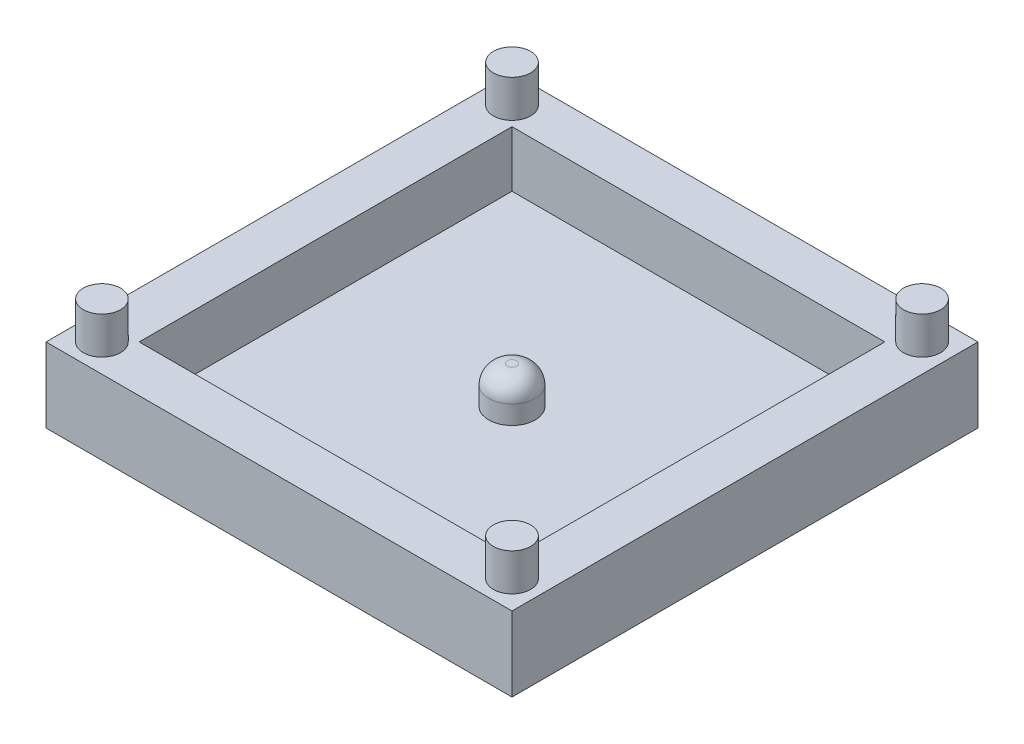
ISO-10303-21;
HEADER;
FILE_DESCRIPTION(('STEP AP214'),'2;1');
FILE_NAME('part.step','',(''),(''),'','','');
FILE_SCHEMA(('AUTOMOTIVE_DESIGN { 1 0 10303 214 1 1 1 1 }'));
ENDSEC;
DATA;
#1=APPLICATION_CONTEXT('core data for automotive mechanical design processes');
#2=APPLICATION_PROTOCOL_DEFINITION('international standard','automotive_design',2000,#1);
#3=PRODUCT_CONTEXT('',#1,'mechanical');
#4=PRODUCT('Part','Part','',(#3));
#5=PRODUCT_RELATED_PRODUCT_CATEGORY('part','',(#4));
#6=PRODUCT_DEFINITION_FORMATION('','',#4);
#7=PRODUCT_DEFINITION_CONTEXT('part definition',#1,'design');
#8=PRODUCT_DEFINITION('design','',#6,#7);
#9=PRODUCT_DEFINITION_SHAPE('','',#8);
#10=(LENGTH_UNIT() NAMED_UNIT(*) SI_UNIT(.MILLI.,.METRE.));
#11=(NAMED_UNIT(*) PLANE_ANGLE_UNIT() SI_UNIT($,.RADIAN.));
#12=(NAMED_UNIT(*) SI_UNIT($,.STERADIAN.) SOLID_ANGLE_UNIT());
#13=UNCERTAINTY_MEASURE_WITH_UNIT(LENGTH_MEASURE(1.E-05),#10,'distance_accuracy_value','');
#14=(GEOMETRIC_REPRESENTATION_CONTEXT(3) GLOBAL_UNCERTAINTY_ASSIGNED_CONTEXT((#13)) GLOBAL_UNIT_ASSIGNED_CONTEXT((#10,
#11,#12)) REPRESENTATION_CONTEXT('',''));
#15=CARTESIAN_POINT('',(0.,0.,0.));
#16=DIRECTION('',(0.,0.,1.));
#17=DIRECTION('',(1.,0.,0.));
#18=AXIS2_PLACEMENT_3D('',#15,#16,#17);
#19=CARTESIAN_POINT('',(12.5,4.,12.5));
#20=DIRECTION('',(-1.,0.,0.));
#21=DIRECTION('',(0.,0.,1.));
#22=AXIS2_PLACEMENT_3D('',#19,#20,#21);
#23=PLANE('',#22);
#24=DIRECTION('',(0.,0.,-1.));
#25=VECTOR('',#24,1.);
#26=CARTESIAN_POINT('',(12.5,0.,12.5));
#27=LINE('',#26,#25);
#28=CARTESIAN_POINT('',(12.5,0.,12.5));
#29=VERTEX_POINT('',#28);
#30=CARTESIAN_POINT('',(12.5,0.,-12.5));
#31=VERTEX_POINT('',#30);
#32=EDGE_CURVE('E146',#29,#31,#27,.T.);
#33=ORIENTED_EDGE('',*,*,#32,.T.);
#34=DIRECTION('',(0.,-1.,0.));
#35=VECTOR('',#34,1.);
#36=CARTESIAN_POINT('',(12.5,4.,-12.5));
#37=LINE('',#36,#35);
#38=CARTESIAN_POINT('',(12.5,4.,-12.5));
#39=VERTEX_POINT('',#38);
#40=EDGE_CURVE('E170',#39,#31,#37,.T.);
#41=ORIENTED_EDGE('',*,*,#40,.F.);
#42=DIRECTION('',(0.,0.,-1.));
#43=VECTOR('',#42,1.);
#44=CARTESIAN_POINT('',(12.5,4.,12.5));
#45=LINE('',#44,#43);
#46=CARTESIAN_POINT('',(12.5,4.,12.5));
#47=VERTEX_POINT('',#46);
#48=EDGE_CURVE('E150',#47,#39,#45,.T.);
#49=ORIENTED_EDGE('',*,*,#48,.F.);
#50=DIRECTION('',(0.,-1.,0.));
#51=VECTOR('',#50,1.);
#52=CARTESIAN_POINT('',(12.5,4.,12.5));
#53=LINE('',#52,#51);
#54=EDGE_CURVE('E156',#47,#29,#53,.T.);
#55=ORIENTED_EDGE('',*,*,#54,.T.);
#56=EDGE_LOOP('',(#33,#41,#49,#55));
#57=FACE_BOUND('',#56,.T.);
#58=ADVANCED_FACE('F33',(#57),#23,.F.);
#59=CARTESIAN_POINT('',(-12.5,4.,-12.5));
#60=DIRECTION('',(0.,0.,1.));
#61=DIRECTION('',(1.,0.,0.));
#62=AXIS2_PLACEMENT_3D('',#59,#60,#61);
#63=PLANE('',#62);
#64=DIRECTION('',(-1.,0.,0.));
#65=VECTOR('',#64,1.);
#66=CARTESIAN_POINT('',(-12.5,0.,-12.5));
#67=LINE('',#66,#65);
#68=CARTESIAN_POINT('',(-12.5,0.,-12.5));
#69=VERTEX_POINT('',#68);
#70=EDGE_CURVE('E159',#31,#69,#67,.T.);
#71=ORIENTED_EDGE('',*,*,#70,.T.);
#72=DIRECTION('',(0.,-1.,0.));
#73=VECTOR('',#72,1.);
#74=CARTESIAN_POINT('',(-12.5,4.,-12.5));
#75=LINE('',#74,#73);
#76=CARTESIAN_POINT('',(-12.5,4.,-12.5));
#77=VERTEX_POINT('',#76);
#78=EDGE_CURVE('E167',#77,#69,#75,.T.);
#79=ORIENTED_EDGE('',*,*,#78,.F.);
#80=DIRECTION('',(-1.,0.,0.));
#81=VECTOR('',#80,1.);
#82=CARTESIAN_POINT('',(-12.5,4.,-12.5));
#83=LINE('',#82,#81);
#84=EDGE_CURVE('E86',#39,#77,#83,.T.);
#85=ORIENTED_EDGE('',*,*,#84,.F.);
#86=ORIENTED_EDGE('',*,*,#40,.T.);
#87=EDGE_LOOP('',(#71,#79,#85,#86));
#88=FACE_BOUND('',#87,.T.);
#89=ADVANCED_FACE('F207',(#88),#63,.F.);
#90=CARTESIAN_POINT('',(-12.5,4.,12.5));
#91=DIRECTION('',(1.,0.,0.));
#92=DIRECTION('',(0.,0.,-1.));
#93=AXIS2_PLACEMENT_3D('',#90,#91,#92);
#94=PLANE('',#93);
#95=DIRECTION('',(0.,0.,1.));
#96=VECTOR('',#95,1.);
#97=CARTESIAN_POINT('',(-12.5,0.,12.5));
#98=LINE('',#97,#96);
#99=CARTESIAN_POINT('',(-12.5,0.,12.5));
#100=VERTEX_POINT('',#99);
#101=EDGE_CURVE('E161',#69,#100,#98,.T.);
#102=ORIENTED_EDGE('',*,*,#101,.T.);
#103=DIRECTION('',(0.,-1.,0.));
#104=VECTOR('',#103,1.);
#105=CARTESIAN_POINT('',(-12.5,4.,12.5));
#106=LINE('',#105,#104);
#107=CARTESIAN_POINT('',(-12.5,4.,12.5));
#108=VERTEX_POINT('',#107);
#109=EDGE_CURVE('E165',#108,#100,#106,.T.);
#110=ORIENTED_EDGE('',*,*,#109,.F.);
#111=DIRECTION('',(0.,0.,1.));
#112=VECTOR('',#111,1.);
#113=CARTESIAN_POINT('',(-12.5,4.,12.5));
#114=LINE('',#113,#112);
#115=EDGE_CURVE('E153',#77,#108,#114,.T.);
#116=ORIENTED_EDGE('',*,*,#115,.F.);
#117=ORIENTED_EDGE('',*,*,#78,.T.);
#118=EDGE_LOOP('',(#102,#110,#116,#117));
#119=FACE_BOUND('',#118,.T.);
#120=ADVANCED_FACE('F212',(#119),#94,.F.);
#121=CARTESIAN_POINT('',(-12.5,4.,12.5));
#122=DIRECTION('',(0.,0.,-1.));
#123=DIRECTION('',(-1.,0.,0.));
#124=AXIS2_PLACEMENT_3D('',#121,#122,#123);
#125=PLANE('',#124);
#126=DIRECTION('',(1.,0.,0.));
#127=VECTOR('',#126,1.);
#128=CARTESIAN_POINT('',(-12.5,0.,12.5));
#129=LINE('',#128,#127);
#130=EDGE_CURVE('E78',#100,#29,#129,.T.);
#131=ORIENTED_EDGE('',*,*,#130,.T.);
#132=ORIENTED_EDGE('',*,*,#54,.F.);
#133=DIRECTION('',(1.,0.,0.));
#134=VECTOR('',#133,1.);
#135=CARTESIAN_POINT('',(-12.5,4.,12.5));
#136=LINE('',#135,#134);
#137=EDGE_CURVE('E57',#108,#47,#136,.T.);
#138=ORIENTED_EDGE('',*,*,#137,.F.);
#139=ORIENTED_EDGE('',*,*,#109,.T.);
#140=EDGE_LOOP('',(#131,#132,#138,#139));
#141=FACE_BOUND('',#140,.T.);
#142=ADVANCED_FACE('F195',(#141),#125,.F.);
#143=CARTESIAN_POINT('',(0.,4.,0.));
#144=DIRECTION('',(0.,-1.,0.));
#145=DIRECTION('',(0.,0.,-1.));
#146=AXIS2_PLACEMENT_3D('',#143,#144,#145);
#147=PLANE('',#146);
#148=CARTESIAN_POINT('',(-11.,4.,11.));
#149=DIRECTION('',(0.,-1.,0.));
#150=DIRECTION('',(0.,0.,-1.));
#151=AXIS2_PLACEMENT_3D('',#148,#149,#150);
#152=CIRCLE('',#151,1.);
#153=CARTESIAN_POINT('',(-11.,4.,10.));
#154=VERTEX_POINT('',#153);
#155=EDGE_CURVE('E11',#154,#154,#152,.F.);
#156=ORIENTED_EDGE('',*,*,#155,.F.);
#157=EDGE_LOOP('',(#156));
#158=FACE_BOUND('',#157,.T.);
#159=CARTESIAN_POINT('',(11.,4.,11.));
#160=DIRECTION('',(0.,-1.,0.));
#161=DIRECTION('',(0.,0.,-1.));
#162=AXIS2_PLACEMENT_3D('',#159,#160,#161);
#163=CIRCLE('',#162,1.);
#164=CARTESIAN_POINT('',(11.,4.,10.));
#165=VERTEX_POINT('',#164);
#166=EDGE_CURVE('E41',#165,#165,#163,.F.);
#167=ORIENTED_EDGE('',*,*,#166,.F.);
#168=EDGE_LOOP('',(#167));
#169=FACE_BOUND('',#168,.T.);
#170=CARTESIAN_POINT('',(11.,4.,-11.));
#171=DIRECTION('',(0.,-1.,0.));
#172=DIRECTION('',(0.,0.,-1.));
#173=AXIS2_PLACEMENT_3D('',#170,#171,#172);
#174=CIRCLE('',#173,1.);
#175=CARTESIAN_POINT('',(11.,4.,-12.));
#176=VERTEX_POINT('',#175);
#177=EDGE_CURVE('E184',#176,#176,#174,.F.);
#178=ORIENTED_EDGE('',*,*,#177,.F.);
#179=EDGE_LOOP('',(#178));
#180=FACE_BOUND('',#179,.T.);
#181=CARTESIAN_POINT('',(-11.,4.,-11.));
#182=DIRECTION('',(0.,-1.,0.));
#183=DIRECTION('',(0.,0.,-1.));
#184=AXIS2_PLACEMENT_3D('',#181,#182,#183);
#185=CIRCLE('',#184,1.);
#186=CARTESIAN_POINT('',(-11.,4.,-12.));
#187=VERTEX_POINT('',#186);
#188=EDGE_CURVE('E181',#187,#187,#185,.F.);
#189=ORIENTED_EDGE('',*,*,#188,.F.);
#190=EDGE_LOOP('',(#189));
#191=FACE_BOUND('',#190,.T.);
#192=DIRECTION('',(-1.,0.,0.));
#193=VECTOR('',#192,1.);
#194=CARTESIAN_POINT('',(-10.,4.,-10.));
#195=LINE('',#194,#193);
#196=CARTESIAN_POINT('',(10.,4.,-10.));
#197=VERTEX_POINT('',#196);
#198=CARTESIAN_POINT('',(-10.,4.,-10.));
#199=VERTEX_POINT('',#198);
#200=EDGE_CURVE('E140',#197,#199,#195,.T.);
#201=ORIENTED_EDGE('',*,*,#200,.F.);
#202=DIRECTION('',(0.,0.,-1.));
#203=VECTOR('',#202,1.);
#204=CARTESIAN_POINT('',(10.,4.,10.));
#205=LINE('',#204,#203);
#206=CARTESIAN_POINT('',(10.,4.,10.));
#207=VERTEX_POINT('',#206);
#208=EDGE_CURVE('E48',#207,#197,#205,.T.);
#209=ORIENTED_EDGE('',*,*,#208,.F.);
#210=DIRECTION('',(1.,0.,0.));
#211=VECTOR('',#210,1.);
#212=CARTESIAN_POINT('',(-10.,4.,10.));
#213=LINE('',#212,#211);
#214=CARTESIAN_POINT('',(-10.,4.,10.));
#215=VERTEX_POINT('',#214);
#216=EDGE_CURVE('E128',#215,#207,#213,.T.);
#217=ORIENTED_EDGE('',*,*,#216,.F.);
#218=DIRECTION('',(0.,0.,1.));
#219=VECTOR('',#218,1.);
#220=CARTESIAN_POINT('',(-10.,4.,10.));
#221=LINE('',#220,#219);
#222=EDGE_CURVE('E131',#199,#215,#221,.T.);
#223=ORIENTED_EDGE('',*,*,#222,.F.);
#224=EDGE_LOOP('',(#201,#209,#217,#223));
#225=FACE_BOUND('',#224,.T.);
#226=ORIENTED_EDGE('',*,*,#48,.T.);
#227=ORIENTED_EDGE('',*,*,#84,.T.);
#228=ORIENTED_EDGE('',*,*,#115,.T.);
#229=ORIENTED_EDGE('',*,*,#137,.T.);
#230=EDGE_LOOP('',(#226,#227,#228,#229));
#231=FACE_BOUND('',#230,.T.);
#232=ADVANCED_FACE('F191',(#158,#169,#180,#191,#225,#231),#147,.F.);
#233=CARTESIAN_POINT('',(0.,0.,0.));
#234=DIRECTION('',(0.,-1.,0.));
#235=DIRECTION('',(0.,0.,-1.));
#236=AXIS2_PLACEMENT_3D('',#233,#234,#235);
#237=PLANE('',#236);
#238=ORIENTED_EDGE('',*,*,#32,.F.);
#239=ORIENTED_EDGE('',*,*,#130,.F.);
#240=ORIENTED_EDGE('',*,*,#101,.F.);
#241=ORIENTED_EDGE('',*,*,#70,.F.);
#242=EDGE_LOOP('',(#238,#239,#240,#241));
#243=FACE_BOUND('',#242,.T.);
#244=ADVANCED_FACE('F194',(#243),#237,.T.);
#245=CARTESIAN_POINT('',(10.,1.,10.));
#246=DIRECTION('',(1.,0.,0.));
#247=DIRECTION('',(0.,0.,-1.));
#248=AXIS2_PLACEMENT_3D('',#245,#246,#247);
#249=PLANE('',#248);
#250=ORIENTED_EDGE('',*,*,#208,.T.);
#251=DIRECTION('',(0.,1.,0.));
#252=VECTOR('',#251,1.);
#253=CARTESIAN_POINT('',(10.,1.,-10.));
#254=LINE('',#253,#252);
#255=CARTESIAN_POINT('',(10.,1.,-10.));
#256=VERTEX_POINT('',#255);
#257=EDGE_CURVE('E106',#256,#197,#254,.T.);
#258=ORIENTED_EDGE('',*,*,#257,.F.);
#259=DIRECTION('',(0.,0.,-1.));
#260=VECTOR('',#259,1.);
#261=CARTESIAN_POINT('',(10.,1.,10.));
#262=LINE('',#261,#260);
#263=CARTESIAN_POINT('',(10.,1.,10.));
#264=VERTEX_POINT('',#263);
#265=EDGE_CURVE('E110',#264,#256,#262,.T.);
#266=ORIENTED_EDGE('',*,*,#265,.F.);
#267=DIRECTION('',(0.,1.,0.));
#268=VECTOR('',#267,1.);
#269=CARTESIAN_POINT('',(10.,1.,10.));
#270=LINE('',#269,#268);
#271=EDGE_CURVE('E144',#264,#207,#270,.T.);
#272=ORIENTED_EDGE('',*,*,#271,.T.);
#273=EDGE_LOOP('',(#250,#258,#266,#272));
#274=FACE_BOUND('',#273,.T.);
#275=ADVANCED_FACE('F108',(#274),#249,.F.);
#276=CARTESIAN_POINT('',(-10.,1.,10.));
#277=DIRECTION('',(0.,0.,1.));
#278=DIRECTION('',(1.,0.,0.));
#279=AXIS2_PLACEMENT_3D('',#276,#277,#278);
#280=PLANE('',#279);
#281=ORIENTED_EDGE('',*,*,#216,.T.);
#282=ORIENTED_EDGE('',*,*,#271,.F.);
#283=DIRECTION('',(1.,0.,0.));
#284=VECTOR('',#283,1.);
#285=CARTESIAN_POINT('',(-10.,1.,10.));
#286=LINE('',#285,#284);
#287=CARTESIAN_POINT('',(-10.,1.,10.));
#288=VERTEX_POINT('',#287);
#289=EDGE_CURVE('E116',#288,#264,#286,.T.);
#290=ORIENTED_EDGE('',*,*,#289,.F.);
#291=DIRECTION('',(0.,1.,0.));
#292=VECTOR('',#291,1.);
#293=CARTESIAN_POINT('',(-10.,1.,10.));
#294=LINE('',#293,#292);
#295=EDGE_CURVE('E147',#288,#215,#294,.T.);
#296=ORIENTED_EDGE('',*,*,#295,.T.);
#297=EDGE_LOOP('',(#281,#282,#290,#296));
#298=FACE_BOUND('',#297,.T.);
#299=ADVANCED_FACE('F219',(#298),#280,.F.);
#300=CARTESIAN_POINT('',(-10.,1.,10.));
#301=DIRECTION('',(-1.,0.,0.));
#302=DIRECTION('',(0.,0.,1.));
#303=AXIS2_PLACEMENT_3D('',#300,#301,#302);
#304=PLANE('',#303);
#305=ORIENTED_EDGE('',*,*,#222,.T.);
#306=ORIENTED_EDGE('',*,*,#295,.F.);
#307=DIRECTION('',(0.,0.,1.));
#308=VECTOR('',#307,1.);
#309=CARTESIAN_POINT('',(-10.,1.,10.));
#310=LINE('',#309,#308);
#311=CARTESIAN_POINT('',(-10.,1.,-10.));
#312=VERTEX_POINT('',#311);
#313=EDGE_CURVE('E124',#312,#288,#310,.T.);
#314=ORIENTED_EDGE('',*,*,#313,.F.);
#315=DIRECTION('',(0.,1.,0.));
#316=VECTOR('',#315,1.);
#317=CARTESIAN_POINT('',(-10.,1.,-10.));
#318=LINE('',#317,#316);
#319=EDGE_CURVE('E115',#312,#199,#318,.T.);
#320=ORIENTED_EDGE('',*,*,#319,.T.);
#321=EDGE_LOOP('',(#305,#306,#314,#320));
#322=FACE_BOUND('',#321,.T.);
#323=ADVANCED_FACE('F342',(#322),#304,.F.);
#324=CARTESIAN_POINT('',(-10.,1.,-10.));
#325=DIRECTION('',(0.,0.,-1.));
#326=DIRECTION('',(-1.,0.,0.));
#327=AXIS2_PLACEMENT_3D('',#324,#325,#326);
#328=PLANE('',#327);
#329=ORIENTED_EDGE('',*,*,#200,.T.);
#330=ORIENTED_EDGE('',*,*,#319,.F.);
#331=DIRECTION('',(-1.,0.,0.));
#332=VECTOR('',#331,1.);
#333=CARTESIAN_POINT('',(-10.,1.,-10.));
#334=LINE('',#333,#332);
#335=EDGE_CURVE('E119',#256,#312,#334,.T.);
#336=ORIENTED_EDGE('',*,*,#335,.F.);
#337=ORIENTED_EDGE('',*,*,#257,.T.);
#338=EDGE_LOOP('',(#329,#330,#336,#337));
#339=FACE_BOUND('',#338,.T.);
#340=ADVANCED_FACE('F120',(#339),#328,.F.);
#341=CARTESIAN_POINT('',(0.,1.,0.));
#342=DIRECTION('',(0.,-1.,0.));
#343=DIRECTION('',(0.,0.,-1.));
#344=AXIS2_PLACEMENT_3D('',#341,#342,#343);
#345=PLANE('',#344);
#346=CARTESIAN_POINT('',(0.,1.,0.));
#347=DIRECTION('',(0.,-1.,0.));
#348=DIRECTION('',(0.,0.,-1.));
#349=AXIS2_PLACEMENT_3D('',#346,#347,#348);
#350=CIRCLE('',#349,1.25);
#351=CARTESIAN_POINT('',(0.,1.,-1.25));
#352=VERTEX_POINT('',#351);
#353=EDGE_CURVE('E172',#352,#352,#350,.F.);
#354=ORIENTED_EDGE('',*,*,#353,.F.);
#355=EDGE_LOOP('',(#354));
#356=FACE_BOUND('',#355,.T.);
#357=ORIENTED_EDGE('',*,*,#265,.T.);
#358=ORIENTED_EDGE('',*,*,#335,.T.);
#359=ORIENTED_EDGE('',*,*,#313,.T.);
#360=ORIENTED_EDGE('',*,*,#289,.T.);
#361=EDGE_LOOP('',(#357,#358,#359,#360));
#362=FACE_BOUND('',#361,.T.);
#363=ADVANCED_FACE('F126',(#356,#362),#345,.F.);
#364=CARTESIAN_POINT('',(0.,3.,0.));
#365=DIRECTION('',(0.,-1.,0.));
#366=DIRECTION('',(0.,0.,-1.));
#367=AXIS2_PLACEMENT_3D('',#364,#365,#366);
#368=CYLINDRICAL_SURFACE('',#367,1.25);
#369=CARTESIAN_POINT('',(0.,2.,0.));
#370=DIRECTION('',(0.,1.,0.));
#371=DIRECTION('',(0.,0.,1.));
#372=AXIS2_PLACEMENT_3D('',#369,#370,#371);
#373=CIRCLE('',#372,1.25);
#374=CARTESIAN_POINT('',(0.,2.,1.25));
#375=VERTEX_POINT('',#374);
#376=EDGE_CURVE('E178',#375,#375,#373,.F.);
#377=ORIENTED_EDGE('',*,*,#376,.T.);
#378=EDGE_LOOP('',(#377));
#379=FACE_BOUND('',#378,.T.);
#380=ORIENTED_EDGE('',*,*,#353,.T.);
#381=EDGE_LOOP('',(#380));
#382=FACE_BOUND('',#381,.T.);
#383=ADVANCED_FACE('F332',(#379,#382),#368,.T.);
#384=CARTESIAN_POINT('',(0.,3.,0.));
#385=DIRECTION('',(0.,1.,0.));
#386=DIRECTION('',(0.,0.,1.));
#387=AXIS2_PLACEMENT_3D('',#384,#385,#386);
#388=PLANE('',#387);
#389=CARTESIAN_POINT('',(0.,3.,0.));
#390=DIRECTION('',(0.,1.,0.));
#391=DIRECTION('',(0.,0.,1.));
#392=AXIS2_PLACEMENT_3D('',#389,#390,#391);
#393=CIRCLE('',#392,0.25);
#394=CARTESIAN_POINT('',(0.,3.,0.25));
#395=VERTEX_POINT('',#394);
#396=EDGE_CURVE('E175',#395,#395,#393,.T.);
#397=ORIENTED_EDGE('',*,*,#396,.T.);
#398=EDGE_LOOP('',(#397));
#399=FACE_BOUND('',#398,.T.);
#400=ADVANCED_FACE('F329',(#399),#388,.T.);
#401=CARTESIAN_POINT('',(0.,2.,0.));
#402=DIRECTION('',(0.,1.,0.));
#403=DIRECTION('',(0.,0.,1.));
#404=AXIS2_PLACEMENT_3D('',#401,#402,#403);
#405=DEGENERATE_TOROIDAL_SURFACE('',#404,0.25,1.,.T.);
#406=ORIENTED_EDGE('',*,*,#376,.F.);
#407=EDGE_LOOP('',(#406));
#408=FACE_BOUND('',#407,.T.);
#409=ORIENTED_EDGE('',*,*,#396,.F.);
#410=EDGE_LOOP('',(#409));
#411=FACE_BOUND('',#410,.T.);
#412=ADVANCED_FACE('F35',(#408,#411),#405,.T.);
#413=CARTESIAN_POINT('',(-11.,6.,-11.));
#414=DIRECTION('',(0.,-1.,0.));
#415=DIRECTION('',(0.,0.,-1.));
#416=AXIS2_PLACEMENT_3D('',#413,#414,#415);
#417=CYLINDRICAL_SURFACE('',#416,1.);
#418=CARTESIAN_POINT('',(-11.,6.,-11.));
#419=DIRECTION('',(0.,1.,0.));
#420=DIRECTION('',(0.,0.,1.));
#421=AXIS2_PLACEMENT_3D('',#418,#419,#420);
#422=CIRCLE('',#421,1.);
#423=CARTESIAN_POINT('',(-11.,6.,-10.));
#424=VERTEX_POINT('',#423);
#425=EDGE_CURVE('E134',#424,#424,#422,.T.);
#426=ORIENTED_EDGE('',*,*,#425,.F.);
#427=EDGE_LOOP('',(#426));
#428=FACE_BOUND('',#427,.T.);
#429=ORIENTED_EDGE('',*,*,#188,.T.);
#430=EDGE_LOOP('',(#429));
#431=FACE_BOUND('',#430,.T.);
#432=ADVANCED_FACE('F249',(#428,#431),#417,.T.);
#433=CARTESIAN_POINT('',(-11.,6.,-11.));
#434=DIRECTION('',(0.,1.,0.));
#435=DIRECTION('',(0.,0.,1.));
#436=AXIS2_PLACEMENT_3D('',#433,#434,#435);
#437=PLANE('',#436);
#438=ORIENTED_EDGE('',*,*,#425,.T.);
#439=EDGE_LOOP('',(#438));
#440=FACE_BOUND('',#439,.T.);
#441=ADVANCED_FACE('F254',(#440),#437,.T.);
#442=CARTESIAN_POINT('',(11.,6.,-11.));
#443=DIRECTION('',(0.,-1.,0.));
#444=DIRECTION('',(0.,0.,-1.));
#445=AXIS2_PLACEMENT_3D('',#442,#443,#444);
#446=CYLINDRICAL_SURFACE('',#445,1.);
#447=CARTESIAN_POINT('',(11.,6.,-11.));
#448=DIRECTION('',(0.,1.,0.));
#449=DIRECTION('',(0.,0.,1.));
#450=AXIS2_PLACEMENT_3D('',#447,#448,#449);
#451=CIRCLE('',#450,1.);
#452=CARTESIAN_POINT('',(11.,6.,-10.));
#453=VERTEX_POINT('',#452);
#454=EDGE_CURVE('E407',#453,#453,#451,.T.);
#455=ORIENTED_EDGE('',*,*,#454,.F.);
#456=EDGE_LOOP('',(#455));
#457=FACE_BOUND('',#456,.T.);
#458=ORIENTED_EDGE('',*,*,#177,.T.);
#459=EDGE_LOOP('',(#458));
#460=FACE_BOUND('',#459,.T.);
#461=ADVANCED_FACE('F264',(#457,#460),#446,.T.);
#462=CARTESIAN_POINT('',(11.,6.,-11.));
#463=DIRECTION('',(0.,1.,0.));
#464=DIRECTION('',(0.,0.,1.));
#465=AXIS2_PLACEMENT_3D('',#462,#463,#464);
#466=PLANE('',#465);
#467=ORIENTED_EDGE('',*,*,#454,.T.);
#468=EDGE_LOOP('',(#467));
#469=FACE_BOUND('',#468,.T.);
#470=ADVANCED_FACE('F274',(#469),#466,.T.);
#471=CARTESIAN_POINT('',(11.,6.,11.));
#472=DIRECTION('',(0.,-1.,0.));
#473=DIRECTION('',(0.,0.,-1.));
#474=AXIS2_PLACEMENT_3D('',#471,#472,#473);
#475=CYLINDRICAL_SURFACE('',#474,1.);
#476=CARTESIAN_POINT('',(11.,6.,11.));
#477=DIRECTION('',(0.,1.,0.));
#478=DIRECTION('',(0.,0.,1.));
#479=AXIS2_PLACEMENT_3D('',#476,#477,#478);
#480=CIRCLE('',#479,1.);
#481=CARTESIAN_POINT('',(11.,6.,12.));
#482=VERTEX_POINT('',#481);
#483=EDGE_CURVE('E404',#482,#482,#480,.T.);
#484=ORIENTED_EDGE('',*,*,#483,.F.);
#485=EDGE_LOOP('',(#484));
#486=FACE_BOUND('',#485,.T.);
#487=ORIENTED_EDGE('',*,*,#166,.T.);
#488=EDGE_LOOP('',(#487));
#489=FACE_BOUND('',#488,.T.);
#490=ADVANCED_FACE('F189',(#486,#489),#475,.T.);
#491=CARTESIAN_POINT('',(11.,6.,11.));
#492=DIRECTION('',(0.,1.,0.));
#493=DIRECTION('',(0.,0.,1.));
#494=AXIS2_PLACEMENT_3D('',#491,#492,#493);
#495=PLANE('',#494);
#496=ORIENTED_EDGE('',*,*,#483,.T.);
#497=EDGE_LOOP('',(#496));
#498=FACE_BOUND('',#497,.T.);
#499=ADVANCED_FACE('F293',(#498),#495,.T.);
#500=CARTESIAN_POINT('',(-11.,6.,11.));
#501=DIRECTION('',(0.,-1.,0.));
#502=DIRECTION('',(0.,0.,-1.));
#503=AXIS2_PLACEMENT_3D('',#500,#501,#502);
#504=CYLINDRICAL_SURFACE('',#503,1.);
#505=CARTESIAN_POINT('',(-11.,6.,11.));
#506=DIRECTION('',(0.,1.,0.));
#507=DIRECTION('',(0.,0.,1.));
#508=AXIS2_PLACEMENT_3D('',#505,#506,#507);
#509=CIRCLE('',#508,1.);
#510=CARTESIAN_POINT('',(-11.,6.,12.));
#511=VERTEX_POINT('',#510);
#512=EDGE_CURVE('E403',#511,#511,#509,.T.);
#513=ORIENTED_EDGE('',*,*,#512,.F.);
#514=EDGE_LOOP('',(#513));
#515=FACE_BOUND('',#514,.T.);
#516=ORIENTED_EDGE('',*,*,#155,.T.);
#517=EDGE_LOOP('',(#516));
#518=FACE_BOUND('',#517,.T.);
#519=ADVANCED_FACE('F303',(#515,#518),#504,.T.);
#520=CARTESIAN_POINT('',(-11.,6.,11.));
#521=DIRECTION('',(0.,1.,0.));
#522=DIRECTION('',(0.,0.,1.));
#523=AXIS2_PLACEMENT_3D('',#520,#521,#522);
#524=PLANE('',#523);
#525=ORIENTED_EDGE('',*,*,#512,.T.);
#526=EDGE_LOOP('',(#525));
#527=FACE_BOUND('',#526,.T.);
#528=ADVANCED_FACE('F313',(#527),#524,.T.);
#529=CLOSED_SHELL('',(#58,#89,#120,#142,#232,#244,#275,#299,#323,#340,#363,#383,#400,#412,#432,
#441,#461,#470,#490,#499,#519,#528));
#530=MANIFOLD_SOLID_BREP('B2',#529);
#531=ADVANCED_BREP_SHAPE_REPRESENTATION('',(#18,#530),#14);
#532=SHAPE_DEFINITION_REPRESENTATION(#9,#531);
ENDSEC;
END-ISO-10303-21;
